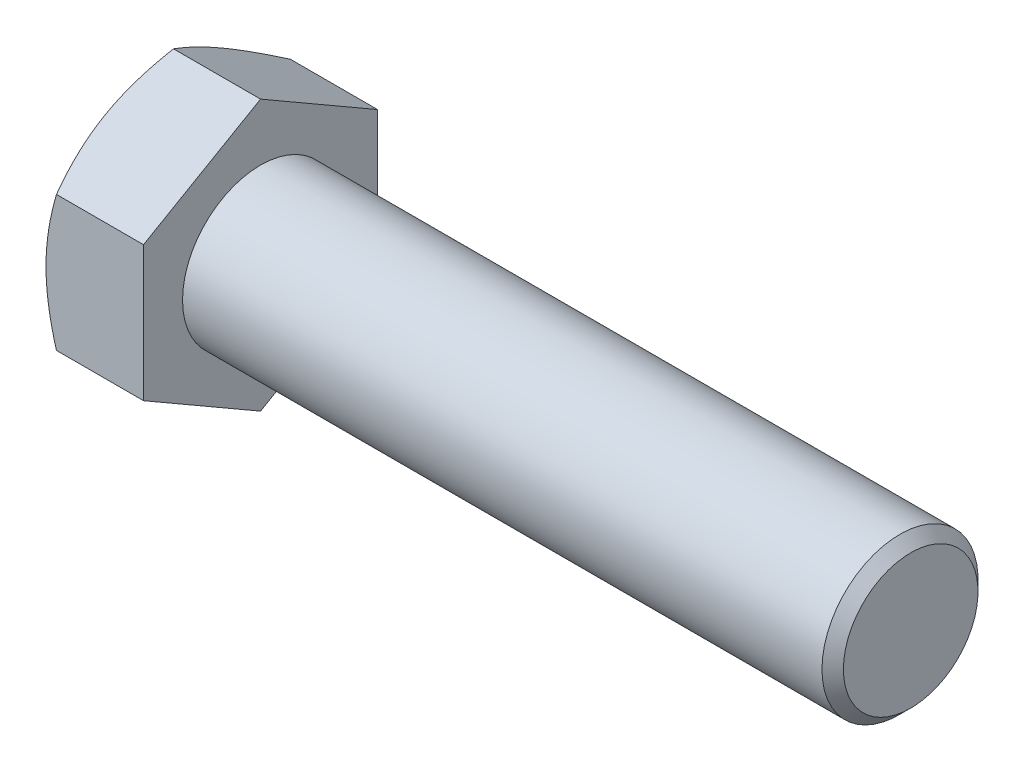
ISO-10303-21;
HEADER;
FILE_DESCRIPTION(('STEP AP214'),'2;1');
FILE_NAME('part.step','',(''),(''),'','','');
FILE_SCHEMA(('AUTOMOTIVE_DESIGN { 1 0 10303 214 1 1 1 1 }'));
ENDSEC;
DATA;
#1=APPLICATION_CONTEXT('core data for automotive mechanical design processes');
#2=APPLICATION_PROTOCOL_DEFINITION('international standard','automotive_design',2000,#1);
#3=PRODUCT_CONTEXT('',#1,'mechanical');
#4=PRODUCT('Part','Part','',(#3));
#5=PRODUCT_RELATED_PRODUCT_CATEGORY('part','',(#4));
#6=PRODUCT_DEFINITION_FORMATION('','',#4);
#7=PRODUCT_DEFINITION_CONTEXT('part definition',#1,'design');
#8=PRODUCT_DEFINITION('design','',#6,#7);
#9=PRODUCT_DEFINITION_SHAPE('','',#8);
#10=(LENGTH_UNIT() NAMED_UNIT(*) SI_UNIT(.MILLI.,.METRE.));
#11=(NAMED_UNIT(*) PLANE_ANGLE_UNIT() SI_UNIT($,.RADIAN.));
#12=(NAMED_UNIT(*) SI_UNIT($,.STERADIAN.) SOLID_ANGLE_UNIT());
#13=UNCERTAINTY_MEASURE_WITH_UNIT(LENGTH_MEASURE(1.E-05),#10,'distance_accuracy_value','');
#14=(GEOMETRIC_REPRESENTATION_CONTEXT(3) GLOBAL_UNCERTAINTY_ASSIGNED_CONTEXT((#13)) GLOBAL_UNIT_ASSIGNED_CONTEXT((#10,
#11,#12)) REPRESENTATION_CONTEXT('',''));
#15=CARTESIAN_POINT('',(0.,0.,0.));
#16=DIRECTION('',(0.,0.,1.));
#17=DIRECTION('',(1.,0.,0.));
#18=AXIS2_PLACEMENT_3D('',#15,#16,#17);
#19=CARTESIAN_POINT('',(15.,10.3923048454132,-18.));
#20=DIRECTION('',(0.,-0.866025403784438,0.500000000000001));
#21=DIRECTION('',(0.,-0.500000000000001,-0.866025403784438));
#22=AXIS2_PLACEMENT_3D('',#19,#20,#21);
#23=PLANE('',#22);
#24=CARTESIAN_POINT('',(1.60776182180895,20.7847251608804,0.000200000000000836));
#25=CARTESIAN_POINT('',(1.47589336556313,20.5563065795853,-0.395432588195887));
#26=CARTESIAN_POINT('',(1.3500088902118,20.3269970432229,-0.792608355835558));
#27=CARTESIAN_POINT('',(1.11187123611099,19.8665391802308,-1.59014476928247));
#28=CARTESIAN_POINT('',(0.999622540659336,19.6353902753093,-1.99050641672051));
#29=CARTESIAN_POINT('',(0.790265297583971,19.1708069369103,-2.79518836317754));
#30=CARTESIAN_POINT('',(0.693192573141017,18.9373684378805,-3.19951570393978));
#31=CARTESIAN_POINT('',(0.516271743787666,18.4688693838575,-4.01097986880547));
#32=CARTESIAN_POINT('',(0.436422652420744,18.2338089225559,-4.41811653063042));
#33=CARTESIAN_POINT('',(0.29734530285486,17.7680889877957,-5.22476711973284));
#34=CARTESIAN_POINT('',(0.237656723113628,17.537464089243,-5.62422116151642));
#35=CARTESIAN_POINT('',(0.137572375669449,17.0751575359747,-6.42495960044929));
#36=CARTESIAN_POINT('',(0.0971769793251374,16.8434758610046,-6.82624403268017));
#37=CARTESIAN_POINT('',(0.0366989588175652,16.3797233284791,-7.62948698115295));
#38=CARTESIAN_POINT('',(0.0165921970388512,16.1476532631882,-8.03144412515262));
#39=CARTESIAN_POINT('',(-0.00287614600259145,15.6832989242254,-8.83572943295137));
#40=CARTESIAN_POINT('',(-0.00223836829112604,15.4510146573942,-9.23805758490178));
#41=CARTESIAN_POINT('',(0.0183335794963781,15.0167538648571,-9.99021934131111));
#42=CARTESIAN_POINT('',(0.0357591844006452,14.8147463980876,-10.3401065372642));
#43=CARTESIAN_POINT('',(0.0859690685012147,14.4112133300948,-11.0390463135619));
#44=CARTESIAN_POINT('',(0.118753127736265,14.209687722012,-11.3880989057876));
#45=CARTESIAN_POINT('',(0.199111057578677,13.8071947240359,-12.0852372279728));
#46=CARTESIAN_POINT('',(0.246698302564822,13.6062280054156,-12.4333217952535));
#47=CARTESIAN_POINT('',(0.355822876567433,13.2052512562621,-13.1278338974413));
#48=CARTESIAN_POINT('',(0.417360146472625,13.0052412216786,-13.4742614393635));
#49=CARTESIAN_POINT('',(0.624462075708551,12.3980849696691,-14.525886915977));
#50=CARTESIAN_POINT('',(0.790677467933134,11.99269701467,-15.228039450812));
#51=CARTESIAN_POINT('',(1.16791817029879,11.1879658503706,-16.6218747138126));
#52=CARTESIAN_POINT('',(1.37885488712769,10.78861233823,-17.3135752870211));
#53=CARTESIAN_POINT('',(1.60776182180894,10.3921893753594,-18.0002));
#54=B_SPLINE_CURVE_WITH_KNOTS('',3,(#24,#25,#26,#27,#28,#29,#30,#31,#32,#33,#34,#35,#36,#37,#38,
#39,#40,#41,#42,#43,#44,#45,#46,#47,#48,#49,#50,#51,#52,#53),.UNSPECIFIED.,.F.,.F.,(4,2,2,2,2,2,
2,2,2,2,2,2,2,2,4),(0.,1.42650335783821,2.85347447244913,4.28376471280638,5.71397301377359,
7.10888071673009,8.50381526803682,9.89708828642551,11.2903182514068,12.5031974791545,
13.7160593367768,14.9300201888636,16.1439758970578,18.6253607678546,21.1018751738864),.UNSPECIFIED.);
#55=CARTESIAN_POINT('',(1.60769515458673,20.7846096908265,0.));
#56=VERTEX_POINT('',#55);
#57=CARTESIAN_POINT('',(0.,15.5884572681199,-9.00000000000002));
#58=VERTEX_POINT('',#57);
#59=EDGE_CURVE('E49',#56,#58,#54,.T.);
#60=ORIENTED_EDGE('',*,*,#59,.F.);
#61=DIRECTION('',(-1.,0.,0.));
#62=VECTOR('',#61,1.);
#63=CARTESIAN_POINT('',(15.,20.7846096908265,0.));
#64=LINE('',#63,#62);
#65=CARTESIAN_POINT('',(15.,20.7846096908265,0.));
#66=VERTEX_POINT('',#65);
#67=EDGE_CURVE('E145',#66,#56,#64,.T.);
#68=ORIENTED_EDGE('',*,*,#67,.F.);
#69=DIRECTION('',(0.,0.500000000000001,0.866025403784438));
#70=VECTOR('',#69,1.);
#71=CARTESIAN_POINT('',(15.,10.3923048454132,-18.));
#72=LINE('',#71,#70);
#73=CARTESIAN_POINT('',(15.,10.3923048454132,-18.));
#74=VERTEX_POINT('',#73);
#75=EDGE_CURVE('E236',#74,#66,#72,.T.);
#76=ORIENTED_EDGE('',*,*,#75,.F.);
#77=DIRECTION('',(-1.,0.,0.));
#78=VECTOR('',#77,1.);
#79=CARTESIAN_POINT('',(15.,10.3923048454132,-18.));
#80=LINE('',#79,#78);
#81=CARTESIAN_POINT('',(1.60769515458672,10.3923048454132,-18.));
#82=VERTEX_POINT('',#81);
#83=EDGE_CURVE('E133',#74,#82,#80,.T.);
#84=ORIENTED_EDGE('',*,*,#83,.T.);
#85=EDGE_CURVE('E127',#58,#82,#54,.T.);
#86=ORIENTED_EDGE('',*,*,#85,.F.);
#87=EDGE_LOOP('',(#60,#68,#76,#84,#86));
#88=FACE_BOUND('',#87,.T.);
#89=ADVANCED_FACE('F33',(#88),#23,.F.);
#90=CARTESIAN_POINT('',(15.,20.7846096908265,0.));
#91=DIRECTION('',(0.,-0.866025403784438,-0.500000000000001));
#92=DIRECTION('',(0.,0.500000000000001,-0.866025403784438));
#93=AXIS2_PLACEMENT_3D('',#90,#91,#92);
#94=PLANE('',#93);
#95=CARTESIAN_POINT('',(1.60776182180894,10.3921893753594,18.0002));
#96=CARTESIAN_POINT('',(1.47589336556312,10.6206079566545,17.6045674118041));
#97=CARTESIAN_POINT('',(1.35000889021179,10.8499174930169,17.2073916441644));
#98=CARTESIAN_POINT('',(1.11187123611098,11.310375356009,16.4098552307175));
#99=CARTESIAN_POINT('',(0.999622540659326,11.5415242609305,16.0094935832795));
#100=CARTESIAN_POINT('',(0.790265297583962,12.0061075993295,15.2048116368225));
#101=CARTESIAN_POINT('',(0.693192573141009,12.2395460983593,14.8004842960602));
#102=CARTESIAN_POINT('',(0.51627174378766,12.7080451523823,13.9890201311945));
#103=CARTESIAN_POINT('',(0.436422652420739,12.9431056136839,13.5818834693696));
#104=CARTESIAN_POINT('',(0.297345302854857,13.4088255484441,12.7752328802672));
#105=CARTESIAN_POINT('',(0.237656723113625,13.6394504469968,12.3757788384836));
#106=CARTESIAN_POINT('',(0.137572375669447,14.1017570002651,11.5750403995507));
#107=CARTESIAN_POINT('',(0.0971769793251351,14.3334386752352,11.1737559673198));
#108=CARTESIAN_POINT('',(0.0366989588175636,14.7971912077607,10.3705130188471));
#109=CARTESIAN_POINT('',(0.0165921970388509,15.0292612730516,9.96855587484738));
#110=CARTESIAN_POINT('',(-0.0028761460025901,15.4936156120144,9.16427056704863));
#111=CARTESIAN_POINT('',(-0.00223836829112426,15.7258998788456,8.76194241509822));
#112=CARTESIAN_POINT('',(0.0183335794963803,16.1601606713826,8.00978065868889));
#113=CARTESIAN_POINT('',(0.0357591844006476,16.3621681381522,7.65989346273577));
#114=CARTESIAN_POINT('',(0.0859690685012189,16.765701206145,6.96095368643809));
#115=CARTESIAN_POINT('',(0.118753127736271,16.9672268142278,6.61190109421242));
#116=CARTESIAN_POINT('',(0.199111057578684,17.3697198122039,5.91476277202716));
#117=CARTESIAN_POINT('',(0.246698302564829,17.5706865308241,5.56667820474646));
#118=CARTESIAN_POINT('',(0.355822876567441,17.9716632799777,4.87216610255867));
#119=CARTESIAN_POINT('',(0.417360146472634,18.1716733145612,4.52573856063651));
#120=CARTESIAN_POINT('',(0.624462075708563,18.7788295665707,3.47411308402299));
#121=CARTESIAN_POINT('',(0.790677467933145,19.1842175215698,2.77196054918801));
#122=CARTESIAN_POINT('',(1.1679181702988,19.9889486858692,1.37812528618742));
#123=CARTESIAN_POINT('',(1.3788548871277,20.3883021980098,0.686424712978885));
#124=CARTESIAN_POINT('',(1.60776182180895,20.7847251608804,-0.000200000000000834));
#125=B_SPLINE_CURVE_WITH_KNOTS('',3,(#95,#96,#97,#98,#99,#100,#101,#102,#103,#104,#105,#106,
#107,#108,#109,#110,#111,#112,#113,#114,#115,#116,#117,#118,#119,#120,#121,#122,#123,#124),
.UNSPECIFIED.,.F.,.F.,(4,2,2,2,2,2,2,2,2,2,2,2,2,2,4),(0.,1.42650335783822,2.85347447244913,
4.28376471280638,5.71397301377359,7.10888071673008,8.50381526803681,9.8970882864255,
11.2903182514068,12.5031974791544,13.7160593367768,14.9300201888636,16.1439758970578,
18.6253607678546,21.1018751738864),.UNSPECIFIED.);
#126=CARTESIAN_POINT('',(1.60769515458672,10.3923048454133,18.));
#127=VERTEX_POINT('',#126);
#128=CARTESIAN_POINT('',(0.,15.5884572681199,9.00000000000002));
#129=VERTEX_POINT('',#128);
#130=EDGE_CURVE('E56',#127,#129,#125,.T.);
#131=ORIENTED_EDGE('',*,*,#130,.F.);
#132=DIRECTION('',(-1.,0.,0.));
#133=VECTOR('',#132,1.);
#134=CARTESIAN_POINT('',(15.,10.3923048454133,18.));
#135=LINE('',#134,#133);
#136=CARTESIAN_POINT('',(15.,10.3923048454133,18.));
#137=VERTEX_POINT('',#136);
#138=EDGE_CURVE('E143',#137,#127,#135,.T.);
#139=ORIENTED_EDGE('',*,*,#138,.F.);
#140=DIRECTION('',(0.,-0.500000000000001,0.866025403784438));
#141=VECTOR('',#140,1.);
#142=CARTESIAN_POINT('',(15.,20.7846096908265,0.));
#143=LINE('',#142,#141);
#144=EDGE_CURVE('E234',#66,#137,#143,.T.);
#145=ORIENTED_EDGE('',*,*,#144,.F.);
#146=ORIENTED_EDGE('',*,*,#67,.T.);
#147=EDGE_CURVE('E160',#129,#56,#125,.T.);
#148=ORIENTED_EDGE('',*,*,#147,.F.);
#149=EDGE_LOOP('',(#131,#139,#145,#146,#148));
#150=FACE_BOUND('',#149,.T.);
#151=ADVANCED_FACE('F166',(#150),#94,.F.);
#152=CARTESIAN_POINT('',(15.,10.3923048454133,18.));
#153=DIRECTION('',(0.,0.,-1.));
#154=DIRECTION('',(0.,1.,0.));
#155=AXIS2_PLACEMENT_3D('',#152,#153,#154);
#156=PLANE('',#155);
#157=CARTESIAN_POINT('',(8.808427130496,-27.9643402431046,18.));
#158=CARTESIAN_POINT('',(8.61750677802229,-27.5710662073959,18.));
#159=CARTESIAN_POINT('',(8.42753472732277,-27.1773320233033,18.));
#160=CARTESIAN_POINT('',(8.04970189891834,-26.3888473520457,18.));
#161=CARTESIAN_POINT('',(7.86184114230335,-25.9940968547769,18.));
#162=CARTESIAN_POINT('',(7.30169863346519,-24.8080724634241,18.));
#163=CARTESIAN_POINT('',(6.93291289399547,-24.0151412252697,18.));
#164=CARTESIAN_POINT('',(6.20490967153255,-22.4196974027513,18.));
#165=CARTESIAN_POINT('',(5.84575478283093,-21.6171561882138,18.));
#166=CARTESIAN_POINT('',(5.14207064659814,-20.0057089274192,18.));
#167=CARTESIAN_POINT('',(4.79754071148437,-19.1968031825104,18.));
#168=CARTESIAN_POINT('',(4.11611022257428,-17.5450041866493,18.));
#169=CARTESIAN_POINT('',(3.77981809482908,-16.7018586270337,18.));
#170=CARTESIAN_POINT('',(3.13256514784992,-15.0057154320914,18.));
#171=CARTESIAN_POINT('',(2.82160716489197,-14.1527167058291,18.));
#172=CARTESIAN_POINT('',(2.23315455016408,-12.43711867356,18.));
#173=CARTESIAN_POINT('',(1.95559259436132,-11.5745426460692,18.));
#174=CARTESIAN_POINT('',(1.44279031196762,-9.83693542713535,18.));
#175=CARTESIAN_POINT('',(1.20753670684013,-8.96190823687535,18.));
#176=CARTESIAN_POINT('',(0.895522308058553,-7.64230427801033,18.));
#177=CARTESIAN_POINT('',(0.798539960307999,-7.20248011867895,18.));
#178=CARTESIAN_POINT('',(0.61934666397991,-6.31981731439132,18.));
#179=CARTESIAN_POINT('',(0.537135413912321,-5.87697873115342,18.));
#180=CARTESIAN_POINT('',(0.388933808123912,-4.98859702789482,18.));
#181=CARTESIAN_POINT('',(0.322942911246029,-4.54305399861045,18.));
#182=CARTESIAN_POINT('',(0.208492383577689,-3.64970631100975,18.));
#183=CARTESIAN_POINT('',(0.160032741349877,-3.20190165416909,18.));
#184=CARTESIAN_POINT('',(0.0822220075298186,-2.31054962941571,18.));
#185=CARTESIAN_POINT('',(0.0526283717185129,-1.86702356479736,18.));
#186=CARTESIAN_POINT('',(0.012226539215199,-0.979118128922018,18.));
#187=CARTESIAN_POINT('',(0.00141802963593598,-0.534738772000976,18.));
#188=CARTESIAN_POINT('',(-0.00115631762080865,0.35407970684775,18.));
#189=CARTESIAN_POINT('',(0.00707792061225486,0.798518829006617,18.));
#190=CARTESIAN_POINT('',(0.0423876675323175,1.68665283494852,18.));
#191=CARTESIAN_POINT('',(0.069464021130165,2.13034768446277,18.));
#192=CARTESIAN_POINT('',(0.156482092926351,3.19520589070312,18.));
#193=CARTESIAN_POINT('',(0.225281528377599,3.81565824171455,18.));
#194=CARTESIAN_POINT('',(0.395990058380339,5.05199420564998,18.));
#195=CARTESIAN_POINT('',(0.497903614582591,5.66787719147405,18.));
#196=CARTESIAN_POINT('',(0.731215030304267,6.89447554273952,18.));
#197=CARTESIAN_POINT('',(0.862635769426437,7.50518651446561,18.));
#198=CARTESIAN_POINT('',(1.15094813703739,8.72049972355144,18.));
#199=CARTESIAN_POINT('',(1.30783938943284,9.3251020509704,18.));
#200=CARTESIAN_POINT('',(1.64698004778297,10.5414936469055,18.));
#201=CARTESIAN_POINT('',(1.82971241990763,11.1531473228725,18.));
#202=CARTESIAN_POINT('',(2.21414736076856,12.3704299751548,18.));
#203=CARTESIAN_POINT('',(2.41585005430054,12.9760589118076,18.));
#204=CARTESIAN_POINT('',(2.83501520647244,14.1815895178699,18.));
#205=CARTESIAN_POINT('',(3.05247247513773,14.7814930003558,18.));
#206=CARTESIAN_POINT('',(3.50057968346486,15.9763233426994,18.));
#207=CARTESIAN_POINT('',(3.73122947137528,16.5712502597116,18.));
#208=CARTESIAN_POINT('',(4.28861115018066,17.9702204857275,18.));
#209=CARTESIAN_POINT('',(4.62002515649325,18.7723954680034,18.));
#210=CARTESIAN_POINT('',(5.29890820133677,20.3699430824083,18.));
#211=CARTESIAN_POINT('',(5.64637822330189,21.1653152943209,18.));
#212=CARTESIAN_POINT('',(6.35417286629493,22.7505167275409,18.));
#213=CARTESIAN_POINT('',(6.7145003341077,23.5403446743747,18.));
#214=CARTESIAN_POINT('',(7.44542750445922,25.1152008413773,18.));
#215=CARTESIAN_POINT('',(7.81602698916609,25.9002291628984,18.));
#216=CARTESIAN_POINT('',(8.56599428613879,27.4671332618931,18.));
#217=CARTESIAN_POINT('',(8.94537123353963,28.2490046594181,18.));
#218=CARTESIAN_POINT('',(9.71100797362349,29.8093695492503,18.));
#219=CARTESIAN_POINT('',(10.0972677957068,30.5878630271109,18.));
#220=CARTESIAN_POINT('',(10.8754456131813,32.1418914548454,18.));
#221=CARTESIAN_POINT('',(11.2673628909044,32.9174267644653,18.));
#222=CARTESIAN_POINT('',(12.0559785801665,34.4660583569055,18.));
#223=CARTESIAN_POINT('',(12.4526769828552,35.2391546442373,18.));
#224=CARTESIAN_POINT('',(13.5822142013125,37.4263866617491,18.));
#225=CARTESIAN_POINT('',(14.3197969559458,38.8380724746762,18.));
#226=CARTESIAN_POINT('',(15.8050655327946,41.6561700073892,18.));
#227=CARTESIAN_POINT('',(16.5527517104897,43.0625815393687,18.));
#228=CARTESIAN_POINT('',(18.0539928572742,45.8677641350797,18.));
#229=CARTESIAN_POINT('',(18.8075285851389,47.2665455031668,18.));
#230=CARTESIAN_POINT('',(19.942334530836,49.3622270652889,18.));
#231=CARTESIAN_POINT('',(20.3213432724281,50.0603536788783,18.));
#232=CARTESIAN_POINT('',(21.0807116459902,51.4558704710998,18.));
#233=CARTESIAN_POINT('',(21.4610712758458,52.1532606508822,18.));
#234=CARTESIAN_POINT('',(21.8420286714726,52.850324235841,18.));
#235=B_SPLINE_CURVE_WITH_KNOTS('',3,(#157,#158,#159,#160,#161,#162,#163,#164,#165,#166,#167,
#168,#169,#170,#171,#172,#173,#174,#175,#176,#177,#178,#179,#180,#181,#182,#183,#184,#185,#186,
#187,#188,#189,#190,#191,#192,#193,#194,#195,#196,#197,#198,#199,#200,#201,#202,#203,#204,#205,
#206,#207,#208,#209,#210,#211,#212,#213,#214,#215,#216,#217,#218,#219,#220,#221,#222,#223,#224,
#225,#226,#227,#228,#229,#230,#231,#232,#233,#234),.UNSPECIFIED.,.F.,.F.,(4,2,2,2,2,2,2,2,2,2,2,
2,2,2,2,2,2,2,2,2,2,2,2,2,2,2,2,2,2,2,2,2,2,2,2,2,2,2,4),(0.,1.31149885283058,2.62301079472824,
5.24642021614437,7.88402931842207,10.5215142775822,13.2444150325257,15.9676202112372,
18.6852401997085,21.4020057650649,22.7529669019192,24.1039004614305,25.4547889438409,
26.8056765449329,28.1388267463276,29.4719547424042,30.8050880527688,32.138281146834,
34.0100119547707,35.8819950561187,37.7554347199951,39.628846723491,41.5435776020437,
43.4583210774805,45.3724366289069,47.286530166998,49.890113594,52.4938567029427,
55.0981799317037,57.7024479744958,60.3095605480866,62.9166842606504,65.5234801070603,
68.1302711287376,72.908489911859,77.6868772522354,82.4533702914907,84.8364880602421,
87.2196021009334),.UNSPECIFIED.);
#236=CARTESIAN_POINT('',(1.60769515458671,-10.3923048454132,18.));
#237=VERTEX_POINT('',#236);
#238=CARTESIAN_POINT('',(0.,0.,18.));
#239=VERTEX_POINT('',#238);
#240=EDGE_CURVE('E246',#237,#239,#235,.T.);
#241=ORIENTED_EDGE('',*,*,#240,.F.);
#242=DIRECTION('',(-1.,0.,0.));
#243=VECTOR('',#242,1.);
#244=CARTESIAN_POINT('',(15.,-10.3923048454132,18.));
#245=LINE('',#244,#243);
#246=CARTESIAN_POINT('',(15.,-10.3923048454132,18.));
#247=VERTEX_POINT('',#246);
#248=EDGE_CURVE('E135',#247,#237,#245,.T.);
#249=ORIENTED_EDGE('',*,*,#248,.F.);
#250=DIRECTION('',(0.,-1.,0.));
#251=VECTOR('',#250,1.);
#252=CARTESIAN_POINT('',(15.,10.3923048454133,18.));
#253=LINE('',#252,#251);
#254=EDGE_CURVE('E230',#137,#247,#253,.T.);
#255=ORIENTED_EDGE('',*,*,#254,.F.);
#256=ORIENTED_EDGE('',*,*,#138,.T.);
#257=EDGE_CURVE('E184',#239,#127,#235,.T.);
#258=ORIENTED_EDGE('',*,*,#257,.F.);
#259=EDGE_LOOP('',(#241,#249,#255,#256,#258));
#260=FACE_BOUND('',#259,.T.);
#261=ADVANCED_FACE('F252',(#260),#156,.F.);
#262=CARTESIAN_POINT('',(15.,-20.7846096908265,0.));
#263=DIRECTION('',(0.,0.866025403784437,-0.500000000000002));
#264=DIRECTION('',(0.,0.500000000000002,0.866025403784438));
#265=AXIS2_PLACEMENT_3D('',#262,#263,#264);
#266=PLANE('',#265);
#267=CARTESIAN_POINT('',(1.60776182180895,-20.7847251608804,-0.000200000000000067));
#268=CARTESIAN_POINT('',(1.47589336556313,-20.5563065795853,0.395432588195888));
#269=CARTESIAN_POINT('',(1.35000889021179,-20.3269970432229,0.79260835583556));
#270=CARTESIAN_POINT('',(1.11187123611098,-19.8665391802308,1.59014476928247));
#271=CARTESIAN_POINT('',(0.999622540659329,-19.6353902753093,1.99050641672051));
#272=CARTESIAN_POINT('',(0.790265297583964,-19.1708069369103,2.79518836317754));
#273=CARTESIAN_POINT('',(0.693192573141011,-18.9373684378805,3.19951570393978));
#274=CARTESIAN_POINT('',(0.516271743787659,-18.4688693838575,4.01097986880547));
#275=CARTESIAN_POINT('',(0.436422652420737,-18.2338089225559,4.41811653063042));
#276=CARTESIAN_POINT('',(0.297345302854853,-17.7680889877957,5.22476711973284));
#277=CARTESIAN_POINT('',(0.237656723113621,-17.537464089243,5.62422116151642));
#278=CARTESIAN_POINT('',(0.137572375669442,-17.0751575359747,6.42495960044928));
#279=CARTESIAN_POINT('',(0.0971769793251287,-16.8434758610045,6.82624403268017));
#280=CARTESIAN_POINT('',(0.0366989588175549,-16.3797233284791,7.62948698115294));
#281=CARTESIAN_POINT('',(0.0165921970388408,-16.1476532631882,8.03144412515262));
#282=CARTESIAN_POINT('',(-0.00287614600260201,-15.6832989242253,8.83572943295136));
#283=CARTESIAN_POINT('',(-0.00223836829113659,-15.4510146573942,9.23805758490178));
#284=CARTESIAN_POINT('',(0.0183335794963686,-15.0167538648571,9.9902193413111));
#285=CARTESIAN_POINT('',(0.0357591844006367,-14.8147463980876,10.3401065372642));
#286=CARTESIAN_POINT('',(0.0859690685012056,-14.4112133300948,11.0390463135619));
#287=CARTESIAN_POINT('',(0.118753127736255,-14.209687722012,11.3880989057876));
#288=CARTESIAN_POINT('',(0.199111057578666,-13.8071947240359,12.0852372279728));
#289=CARTESIAN_POINT('',(0.246698302564811,-13.6062280054156,12.4333217952535));
#290=CARTESIAN_POINT('',(0.355822876567423,-13.205251256262,13.1278338974413));
#291=CARTESIAN_POINT('',(0.417360146472615,-13.0052412216786,13.4742614393635));
#292=CARTESIAN_POINT('',(0.624462075708542,-12.3980849696691,14.525886915977));
#293=CARTESIAN_POINT('',(0.790677467933124,-11.9926970146699,15.228039450812));
#294=CARTESIAN_POINT('',(1.16791817029878,-11.1879658503706,16.6218747138126));
#295=CARTESIAN_POINT('',(1.37885488712768,-10.78861233823,17.3135752870211));
#296=CARTESIAN_POINT('',(1.60776182180893,-10.3921893753594,18.0002));
#297=B_SPLINE_CURVE_WITH_KNOTS('',3,(#267,#268,#269,#270,#271,#272,#273,#274,#275,#276,#277,
#278,#279,#280,#281,#282,#283,#284,#285,#286,#287,#288,#289,#290,#291,#292,#293,#294,#295,#296),
.UNSPECIFIED.,.F.,.F.,(4,2,2,2,2,2,2,2,2,2,2,2,2,2,4),(0.,1.42650335783821,2.85347447244913,
4.28376471280638,5.71397301377359,7.10888071673008,8.50381526803681,9.8970882864255,
11.2903182514068,12.5031974791544,13.7160593367768,14.9300201888636,16.1439758970578,
18.6253607678546,21.1018751738865),.UNSPECIFIED.);
#298=CARTESIAN_POINT('',(1.60769515458673,-20.7846096908265,0.));
#299=VERTEX_POINT('',#298);
#300=CARTESIAN_POINT('',(0.,-15.5884572681199,9.00000000000004));
#301=VERTEX_POINT('',#300);
#302=EDGE_CURVE('E168',#299,#301,#297,.T.);
#303=ORIENTED_EDGE('',*,*,#302,.F.);
#304=DIRECTION('',(-1.,0.,0.));
#305=VECTOR('',#304,1.);
#306=CARTESIAN_POINT('',(15.,-20.7846096908265,0.));
#307=LINE('',#306,#305);
#308=CARTESIAN_POINT('',(15.,-20.7846096908265,0.));
#309=VERTEX_POINT('',#308);
#310=EDGE_CURVE('E132',#309,#299,#307,.T.);
#311=ORIENTED_EDGE('',*,*,#310,.F.);
#312=DIRECTION('',(0.,-0.500000000000002,-0.866025403784437));
#313=VECTOR('',#312,1.);
#314=CARTESIAN_POINT('',(15.,-20.7846096908265,0.));
#315=LINE('',#314,#313);
#316=EDGE_CURVE('E228',#247,#309,#315,.T.);
#317=ORIENTED_EDGE('',*,*,#316,.F.);
#318=ORIENTED_EDGE('',*,*,#248,.T.);
#319=EDGE_CURVE('E170',#301,#237,#297,.T.);
#320=ORIENTED_EDGE('',*,*,#319,.F.);
#321=EDGE_LOOP('',(#303,#311,#317,#318,#320));
#322=FACE_BOUND('',#321,.T.);
#323=ADVANCED_FACE('F224',(#322),#266,.F.);
#324=CARTESIAN_POINT('',(15.,-10.3923048454133,-18.));
#325=DIRECTION('',(0.,0.866025403784439,0.5));
#326=DIRECTION('',(0.,-0.5,0.866025403784439));
#327=AXIS2_PLACEMENT_3D('',#324,#325,#326);
#328=PLANE('',#327);
#329=CARTESIAN_POINT('',(1.60776182180895,-10.3921893753594,-18.0002));
#330=CARTESIAN_POINT('',(1.47589336556313,-10.6206079566545,-17.6045674118041));
#331=CARTESIAN_POINT('',(1.3500088902118,-10.8499174930169,-17.2073916441644));
#332=CARTESIAN_POINT('',(1.11187123611099,-11.310375356009,-16.4098552307175));
#333=CARTESIAN_POINT('',(0.999622540659336,-11.5415242609305,-16.0094935832795));
#334=CARTESIAN_POINT('',(0.790265297583972,-12.0061075993295,-15.2048116368225));
#335=CARTESIAN_POINT('',(0.693192573141018,-12.2395460983593,-14.8004842960602));
#336=CARTESIAN_POINT('',(0.516271743787668,-12.7080451523823,-13.9890201311945));
#337=CARTESIAN_POINT('',(0.436422652420747,-12.9431056136839,-13.5818834693696));
#338=CARTESIAN_POINT('',(0.297345302854864,-13.4088255484441,-12.7752328802672));
#339=CARTESIAN_POINT('',(0.237656723113632,-13.6394504469968,-12.3757788384836));
#340=CARTESIAN_POINT('',(0.137572375669453,-14.1017570002651,-11.5750403995507));
#341=CARTESIAN_POINT('',(0.0971769793251403,-14.3334386752353,-11.1737559673198));
#342=CARTESIAN_POINT('',(0.0366989588175689,-14.7971912077607,-10.370513018847));
#343=CARTESIAN_POINT('',(0.0165921970388565,-15.0292612730516,-9.96855587484737));
#344=CARTESIAN_POINT('',(-0.0028761460025847,-15.4936156120145,-9.16427056704861));
#345=CARTESIAN_POINT('',(-0.00223836829111947,-15.7258998788456,-8.7619424150982));
#346=CARTESIAN_POINT('',(0.0183335794963855,-16.1601606713827,-8.00978065868888));
#347=CARTESIAN_POINT('',(0.0357591844006535,-16.3621681381522,-7.65989346273576));
#348=CARTESIAN_POINT('',(0.085969068501224,-16.765701206145,-6.96095368643808));
#349=CARTESIAN_POINT('',(0.118753127736275,-16.9672268142278,-6.61190109421241));
#350=CARTESIAN_POINT('',(0.199111057578687,-17.3697198122039,-5.91476277202715));
#351=CARTESIAN_POINT('',(0.246698302564833,-17.5706865308241,-5.56667820474646));
#352=CARTESIAN_POINT('',(0.355822876567444,-17.9716632799777,-4.87216610255866));
#353=CARTESIAN_POINT('',(0.417360146472635,-18.1716733145612,-4.5257385606365));
#354=CARTESIAN_POINT('',(0.624462075708559,-18.7788295665707,-3.47411308402298));
#355=CARTESIAN_POINT('',(0.790677467933142,-19.1842175215698,-2.77196054918801));
#356=CARTESIAN_POINT('',(1.16791817029879,-19.9889486858692,-1.37812528618742));
#357=CARTESIAN_POINT('',(1.3788548871277,-20.3883021980098,-0.686424712978884));
#358=CARTESIAN_POINT('',(1.60776182180895,-20.7847251608804,0.000199999999999858));
#359=B_SPLINE_CURVE_WITH_KNOTS('',3,(#329,#330,#331,#332,#333,#334,#335,#336,#337,#338,#339,
#340,#341,#342,#343,#344,#345,#346,#347,#348,#349,#350,#351,#352,#353,#354,#355,#356,#357,#358),
.UNSPECIFIED.,.F.,.F.,(4,2,2,2,2,2,2,2,2,2,2,2,2,2,4),(0.,1.42650335783821,2.85347447244913,
4.28376471280638,5.71397301377359,7.10888071673009,8.50381526803682,9.89708828642551,
11.2903182514068,12.5031974791545,13.7160593367768,14.9300201888636,16.1439758970578,
18.6253607678546,21.1018751738864),.UNSPECIFIED.);
#360=CARTESIAN_POINT('',(1.60769515458673,-10.3923048454133,-18.));
#361=VERTEX_POINT('',#360);
#362=CARTESIAN_POINT('',(0.,-15.5884572681199,-8.99999999999999));
#363=VERTEX_POINT('',#362);
#364=EDGE_CURVE('E109',#361,#363,#359,.T.);
#365=ORIENTED_EDGE('',*,*,#364,.F.);
#366=DIRECTION('',(-1.,0.,0.));
#367=VECTOR('',#366,1.);
#368=CARTESIAN_POINT('',(15.,-10.3923048454133,-18.));
#369=LINE('',#368,#367);
#370=CARTESIAN_POINT('',(15.,-10.3923048454133,-18.));
#371=VERTEX_POINT('',#370);
#372=EDGE_CURVE('E123',#371,#361,#369,.T.);
#373=ORIENTED_EDGE('',*,*,#372,.F.);
#374=DIRECTION('',(0.,0.5,-0.866025403784439));
#375=VECTOR('',#374,1.);
#376=CARTESIAN_POINT('',(15.,-10.3923048454133,-18.));
#377=LINE('',#376,#375);
#378=EDGE_CURVE('E226',#309,#371,#377,.T.);
#379=ORIENTED_EDGE('',*,*,#378,.F.);
#380=ORIENTED_EDGE('',*,*,#310,.T.);
#381=EDGE_CURVE('E126',#363,#299,#359,.T.);
#382=ORIENTED_EDGE('',*,*,#381,.F.);
#383=EDGE_LOOP('',(#365,#373,#379,#380,#382));
#384=FACE_BOUND('',#383,.T.);
#385=ADVANCED_FACE('F121',(#384),#328,.F.);
#386=CARTESIAN_POINT('',(15.,10.3923048454132,-18.));
#387=DIRECTION('',(0.,0.,1.));
#388=DIRECTION('',(0.,-1.,0.));
#389=AXIS2_PLACEMENT_3D('',#386,#387,#388);
#390=PLANE('',#389);
#391=CARTESIAN_POINT('',(8.80842713097472,-27.9643402440907,-18.));
#392=CARTESIAN_POINT('',(8.617506778491,-27.5710662083654,-18.));
#393=CARTESIAN_POINT('',(8.42753472778147,-27.1773320242562,-18.));
#394=CARTESIAN_POINT('',(8.04970189935704,-26.3888473529655,-18.));
#395=CARTESIAN_POINT('',(7.86184114273206,-25.9940968556801,-18.));
#396=CARTESIAN_POINT('',(7.30169863386396,-24.8080724642775,-18.));
#397=CARTESIAN_POINT('',(6.93291289437432,-24.0151412260899,-18.));
#398=CARTESIAN_POINT('',(6.20490967187157,-22.4196974035044,-18.));
#399=CARTESIAN_POINT('',(5.84575478315001,-21.6171561889331,-18.));
#400=CARTESIAN_POINT('',(5.1420706468777,-20.0057089280707,-18.));
#401=CARTESIAN_POINT('',(4.79754071174434,-19.196803183128,-18.));
#402=CARTESIAN_POINT('',(4.11611022279456,-17.5450041871963,-18.));
#403=CARTESIAN_POINT('',(3.7798180950293,-16.7018586275441,-18.));
#404=CARTESIAN_POINT('',(3.1325651480111,-15.005715432528,-18.));
#405=CARTESIAN_POINT('',(2.82160716503417,-14.1527167062286,-18.));
#406=CARTESIAN_POINT('',(2.23315455027017,-12.4371186738844,-18.));
#407=CARTESIAN_POINT('',(1.95559259445028,-11.5745426463558,-18.));
#408=CARTESIAN_POINT('',(1.44279031202514,-9.8369354273451,-18.));
#409=CARTESIAN_POINT('',(1.20753670688334,-8.96190823704618,-18.));
#410=CARTESIAN_POINT('',(0.895522308081286,-7.64230427811239,-18.));
#411=CARTESIAN_POINT('',(0.798539960323235,-7.20248011875153,-18.));
#412=CARTESIAN_POINT('',(0.619346663982096,-6.31981731440452,-18.));
#413=CARTESIAN_POINT('',(0.537135413908953,-5.87697873113672,-18.));
#414=CARTESIAN_POINT('',(0.388933808111684,-4.98859702781801,-18.));
#415=CARTESIAN_POINT('',(0.322942911230495,-4.54305399850343,-18.));
#416=CARTESIAN_POINT('',(0.208492383558031,-3.64970631084204,-18.));
#417=CARTESIAN_POINT('',(0.160032741329401,-3.20190165397091,-18.));
#418=CARTESIAN_POINT('',(0.082222007510393,-2.31054962915723,-18.));
#419=CARTESIAN_POINT('',(0.0526283717009072,-1.86702356450906,-18.));
#420=CARTESIAN_POINT('',(0.0122265392038566,-0.979118128574127,-18.));
#421=CARTESIAN_POINT('',(0.0014180296290367,-0.534738771623327,-18.));
#422=CARTESIAN_POINT('',(-0.00115631761626913,0.354079707284689,-18.));
#423=CARTESIAN_POINT('',(0.00707792062379077,0.798518829473088,-18.));
#424=CARTESIAN_POINT('',(0.0423876675602103,1.68665283547366,-18.));
#425=CARTESIAN_POINT('',(0.0694640211674182,2.13034768501705,-18.));
#426=CARTESIAN_POINT('',(0.156482092986642,3.19520589130288,-18.));
#427=CARTESIAN_POINT('',(0.225281528451191,3.81565824233053,-18.));
#428=CARTESIAN_POINT('',(0.395990058481245,5.05199420629767,-18.));
#429=CARTESIAN_POINT('',(0.49790361469751,5.66787719213724,-18.));
#430=CARTESIAN_POINT('',(0.731215030447439,6.89447554343314,-18.));
#431=CARTESIAN_POINT('',(0.862635769583851,7.50518651517417,-18.));
#432=CARTESIAN_POINT('',(1.15094813722315,8.72049972428945,-18.));
#433=CARTESIAN_POINT('',(1.30783938963271,9.32510205172292,-18.));
#434=CARTESIAN_POINT('',(1.64698004801114,10.5414936476874,-18.));
#435=CARTESIAN_POINT('',(1.82971242014998,11.1531473236693,-18.));
#436=CARTESIAN_POINT('',(2.21414736103885,12.3704299759813,-18.));
#437=CARTESIAN_POINT('',(2.4158500545846,12.9760589126488,-18.));
#438=CARTESIAN_POINT('',(2.83501520678354,14.1815895187405,-18.));
#439=CARTESIAN_POINT('',(3.05247247546212,14.7814930012409,-18.));
#440=CARTESIAN_POINT('',(3.50057968381538,15.9763233436138,-18.));
#441=CARTESIAN_POINT('',(3.73122947173864,16.5712502606406,-18.));
#442=CARTESIAN_POINT('',(4.28861115056411,17.9702204866666,-18.));
#443=CARTESIAN_POINT('',(4.62002515688315,18.7723954689383,-18.));
#444=CARTESIAN_POINT('',(5.29890820173806,20.3699430833353,-18.));
#445=CARTESIAN_POINT('',(5.64637822370813,21.1653152952441,-18.));
#446=CARTESIAN_POINT('',(6.35417286670989,22.750516728457,-18.));
#447=CARTESIAN_POINT('',(6.71450033452646,23.5403446752873,-18.));
#448=CARTESIAN_POINT('',(7.44542750488467,25.1152008422835,-18.));
#449=CARTESIAN_POINT('',(7.81602698959445,25.9002291638017,-18.));
#450=CARTESIAN_POINT('',(8.56599428657223,27.4671332627904,-18.));
#451=CARTESIAN_POINT('',(8.94537123397526,28.2490046603126,-18.));
#452=CARTESIAN_POINT('',(9.71100797406294,29.8093695501392,-18.));
#453=CARTESIAN_POINT('',(10.0972677961478,30.5878630279972,-18.));
#454=CARTESIAN_POINT('',(10.8754456136253,32.1418914557266,-18.));
#455=CARTESIAN_POINT('',(11.2673628913496,32.9174267653441,-18.));
#456=CARTESIAN_POINT('',(12.0559785806139,34.4660583577795,-18.));
#457=CARTESIAN_POINT('',(12.4526769833034,35.239154645109,-18.));
#458=CARTESIAN_POINT('',(13.5822142017647,37.4263866626177,-18.));
#459=CARTESIAN_POINT('',(14.3197969564005,38.8380724755441,-18.));
#460=CARTESIAN_POINT('',(15.805065533254,41.656170008256,-18.));
#461=CARTESIAN_POINT('',(16.5527517109513,43.062581540235,-18.));
#462=CARTESIAN_POINT('',(18.0539928577398,45.8677641359459,-18.));
#463=CARTESIAN_POINT('',(18.8075285856065,47.2665455040334,-18.));
#464=CARTESIAN_POINT('',(19.9423345313063,49.362227066156,-18.));
#465=CARTESIAN_POINT('',(20.3213432728994,50.0603536797457,-18.));
#466=CARTESIAN_POINT('',(21.0807116464631,51.4558704719676,-18.));
#467=CARTESIAN_POINT('',(21.4610712763196,52.1532606517502,-18.));
#468=CARTESIAN_POINT('',(21.8420286719472,52.8503242367093,-18.));
#469=B_SPLINE_CURVE_WITH_KNOTS('',3,(#391,#392,#393,#394,#395,#396,#397,#398,#399,#400,#401,
#402,#403,#404,#405,#406,#407,#408,#409,#410,#411,#412,#413,#414,#415,#416,#417,#418,#419,#420,
#421,#422,#423,#424,#425,#426,#427,#428,#429,#430,#431,#432,#433,#434,#435,#436,#437,#438,#439,
#440,#441,#442,#443,#444,#445,#446,#447,#448,#449,#450,#451,#452,#453,#454,#455,#456,#457,#458,
#459,#460,#461,#462,#463,#464,#465,#466,#467,#468),.UNSPECIFIED.,.F.,.F.,(4,2,2,2,2,2,2,2,2,2,2,
2,2,2,2,2,2,2,2,2,2,2,2,2,2,2,2,2,2,2,2,2,2,2,2,2,2,2,4),(0.,1.31149885288839,2.62301079484386,
5.24642021637564,7.88402931877025,10.5215142780473,13.244415033115,15.9676202119508,
18.6852402005459,21.4020057660261,22.7529669029715,24.1039004625739,25.4547889450755,
26.8056765462585,28.138826747742,29.4719547439074,30.805088054361,32.1382811485151,
34.0100119565044,35.8819950579052,37.7554347218344,39.6288467253831,41.5435776039908,
43.4583210794826,45.3724366309638,47.2865301691098,49.8901135961075,52.4938567050458,
55.0981799338023,57.70244797659,60.3095605501759,62.9166842627348,65.5234801091398,
68.1302711308122,72.9084899139354,77.6868772543136,82.4533702935725,84.8364880623258,
87.219602103019),.UNSPECIFIED.);
#470=CARTESIAN_POINT('',(0.,0.,-18.));
#471=VERTEX_POINT('',#470);
#472=EDGE_CURVE('E115',#82,#471,#469,.F.);
#473=ORIENTED_EDGE('',*,*,#472,.F.);
#474=ORIENTED_EDGE('',*,*,#83,.F.);
#475=DIRECTION('',(0.,1.,0.));
#476=VECTOR('',#475,1.);
#477=CARTESIAN_POINT('',(15.,10.3923048454132,-18.));
#478=LINE('',#477,#476);
#479=EDGE_CURVE('E131',#371,#74,#478,.T.);
#480=ORIENTED_EDGE('',*,*,#479,.F.);
#481=ORIENTED_EDGE('',*,*,#372,.T.);
#482=EDGE_CURVE('E106',#471,#361,#469,.F.);
#483=ORIENTED_EDGE('',*,*,#482,.F.);
#484=EDGE_LOOP('',(#473,#474,#480,#481,#483));
#485=FACE_BOUND('',#484,.T.);
#486=ADVANCED_FACE('F129',(#485),#390,.F.);
#487=CARTESIAN_POINT('',(15.,20.7846096908265,0.));
#488=DIRECTION('',(1.,0.,0.));
#489=DIRECTION('',(0.,0.,-1.));
#490=AXIS2_PLACEMENT_3D('',#487,#488,#489);
#491=PLANE('',#490);
#492=CARTESIAN_POINT('',(15.,0.,0.));
#493=DIRECTION('',(1.,0.,0.));
#494=DIRECTION('',(0.,0.,-1.));
#495=AXIS2_PLACEMENT_3D('',#492,#493,#494);
#496=CIRCLE('',#495,12.);
#497=CARTESIAN_POINT('',(15.,0.,-12.));
#498=VERTEX_POINT('',#497);
#499=EDGE_CURVE('E239',#498,#498,#496,.F.);
#500=ORIENTED_EDGE('',*,*,#499,.T.);
#501=EDGE_LOOP('',(#500));
#502=FACE_BOUND('',#501,.T.);
#503=ORIENTED_EDGE('',*,*,#75,.T.);
#504=ORIENTED_EDGE('',*,*,#144,.T.);
#505=ORIENTED_EDGE('',*,*,#254,.T.);
#506=ORIENTED_EDGE('',*,*,#316,.T.);
#507=ORIENTED_EDGE('',*,*,#378,.T.);
#508=ORIENTED_EDGE('',*,*,#479,.T.);
#509=EDGE_LOOP('',(#503,#504,#505,#506,#507,#508));
#510=FACE_BOUND('',#509,.T.);
#511=ADVANCED_FACE('F254',(#502,#510),#491,.T.);
#512=CARTESIAN_POINT('',(0.,0.,0.));
#513=DIRECTION('',(-1.,0.,0.));
#514=DIRECTION('',(0.,0.,1.));
#515=AXIS2_PLACEMENT_3D('',#512,#513,#514);
#516=CYLINDRICAL_SURFACE('',#515,12.);
#517=ORIENTED_EDGE('',*,*,#499,.F.);
#518=EDGE_LOOP('',(#517));
#519=FACE_BOUND('',#518,.T.);
#520=CARTESIAN_POINT('',(113.352,0.,0.));
#521=DIRECTION('',(-1.,0.,0.));
#522=DIRECTION('',(0.,0.,1.));
#523=AXIS2_PLACEMENT_3D('',#520,#521,#522);
#524=CIRCLE('',#523,12.);
#525=CARTESIAN_POINT('',(113.352,0.,12.));
#526=VERTEX_POINT('',#525);
#527=EDGE_CURVE('E242',#526,#526,#524,.T.);
#528=ORIENTED_EDGE('',*,*,#527,.T.);
#529=EDGE_LOOP('',(#528));
#530=FACE_BOUND('',#529,.T.);
#531=ADVANCED_FACE('F285',(#519,#530),#516,.T.);
#532=CARTESIAN_POINT('',(115.,0.,0.));
#533=DIRECTION('',(-1.,0.,0.));
#534=DIRECTION('',(0.,0.,1.));
#535=AXIS2_PLACEMENT_3D('',#532,#533,#534);
#536=CONICAL_SURFACE('',#535,10.352,0.785398163397441);
#537=ORIENTED_EDGE('',*,*,#527,.F.);
#538=EDGE_LOOP('',(#537));
#539=FACE_BOUND('',#538,.T.);
#540=CARTESIAN_POINT('',(115.,0.,0.));
#541=DIRECTION('',(-1.,0.,0.));
#542=DIRECTION('',(0.,0.,1.));
#543=AXIS2_PLACEMENT_3D('',#540,#541,#542);
#544=CIRCLE('',#543,10.352);
#545=CARTESIAN_POINT('',(115.,0.,10.352));
#546=VERTEX_POINT('',#545);
#547=EDGE_CURVE('E244',#546,#546,#544,.T.);
#548=ORIENTED_EDGE('',*,*,#547,.T.);
#549=EDGE_LOOP('',(#548));
#550=FACE_BOUND('',#549,.T.);
#551=ADVANCED_FACE('F288',(#539,#550),#536,.T.);
#552=CARTESIAN_POINT('',(115.,0.,0.));
#553=DIRECTION('',(-1.,0.,0.));
#554=DIRECTION('',(0.,0.,1.));
#555=AXIS2_PLACEMENT_3D('',#552,#553,#554);
#556=PLANE('',#555);
#557=ORIENTED_EDGE('',*,*,#547,.F.);
#558=EDGE_LOOP('',(#557));
#559=FACE_BOUND('',#558,.T.);
#560=ADVANCED_FACE('F198',(#559),#556,.F.);
#561=CARTESIAN_POINT('',(0.,0.,0.));
#562=DIRECTION('',(1.,0.,0.));
#563=DIRECTION('',(0.,0.,-1.));
#564=AXIS2_PLACEMENT_3D('',#561,#562,#563);
#565=CONICAL_SURFACE('',#564,18.,1.0471975511966);
#566=ORIENTED_EDGE('',*,*,#364,.T.);
#567=CARTESIAN_POINT('',(0.,0.,0.));
#568=DIRECTION('',(1.,0.,0.));
#569=DIRECTION('',(0.,0.,-1.));
#570=AXIS2_PLACEMENT_3D('',#567,#568,#569);
#571=CIRCLE('',#570,18.);
#572=EDGE_CURVE('E37',#363,#471,#571,.T.);
#573=ORIENTED_EDGE('',*,*,#572,.T.);
#574=ORIENTED_EDGE('',*,*,#482,.T.);
#575=EDGE_LOOP('',(#566,#573,#574));
#576=FACE_BOUND('',#575,.T.);
#577=ADVANCED_FACE('F108',(#576),#565,.T.);
#578=ORIENTED_EDGE('',*,*,#302,.T.);
#579=EDGE_CURVE('E150',#301,#363,#571,.T.);
#580=ORIENTED_EDGE('',*,*,#579,.T.);
#581=ORIENTED_EDGE('',*,*,#381,.T.);
#582=EDGE_LOOP('',(#578,#580,#581));
#583=FACE_BOUND('',#582,.T.);
#584=ADVANCED_FACE('F197',(#583),#565,.T.);
#585=ORIENTED_EDGE('',*,*,#240,.T.);
#586=EDGE_CURVE('E151',#239,#301,#571,.T.);
#587=ORIENTED_EDGE('',*,*,#586,.T.);
#588=ORIENTED_EDGE('',*,*,#319,.T.);
#589=EDGE_LOOP('',(#585,#587,#588));
#590=FACE_BOUND('',#589,.T.);
#591=ADVANCED_FACE('F192',(#590),#565,.T.);
#592=ORIENTED_EDGE('',*,*,#257,.T.);
#593=ORIENTED_EDGE('',*,*,#130,.T.);
#594=CARTESIAN_POINT('',(0.,0.,0.));
#595=DIRECTION('',(-1.,0.,0.));
#596=DIRECTION('',(0.,0.,1.));
#597=AXIS2_PLACEMENT_3D('',#594,#595,#596);
#598=CIRCLE('',#597,18.);
#599=EDGE_CURVE('E116',#239,#129,#598,.T.);
#600=ORIENTED_EDGE('',*,*,#599,.F.);
#601=EDGE_LOOP('',(#592,#593,#600));
#602=FACE_BOUND('',#601,.T.);
#603=ADVANCED_FACE('F196',(#602),#565,.T.);
#604=ORIENTED_EDGE('',*,*,#147,.T.);
#605=ORIENTED_EDGE('',*,*,#59,.T.);
#606=EDGE_CURVE('E42',#58,#129,#571,.T.);
#607=ORIENTED_EDGE('',*,*,#606,.T.);
#608=EDGE_LOOP('',(#604,#605,#607));
#609=FACE_BOUND('',#608,.T.);
#610=ADVANCED_FACE('F159',(#609),#565,.T.);
#611=ORIENTED_EDGE('',*,*,#85,.T.);
#612=ORIENTED_EDGE('',*,*,#472,.T.);
#613=EDGE_CURVE('E11',#471,#58,#571,.T.);
#614=ORIENTED_EDGE('',*,*,#613,.T.);
#615=EDGE_LOOP('',(#611,#612,#614));
#616=FACE_BOUND('',#615,.T.);
#617=ADVANCED_FACE('F257',(#616),#565,.T.);
#618=CARTESIAN_POINT('',(0.,20.7846096908265,0.));
#619=DIRECTION('',(1.,0.,0.));
#620=DIRECTION('',(0.,0.,-1.));
#621=AXIS2_PLACEMENT_3D('',#618,#619,#620);
#622=PLANE('',#621);
#623=ORIENTED_EDGE('',*,*,#613,.F.);
#624=ORIENTED_EDGE('',*,*,#572,.F.);
#625=ORIENTED_EDGE('',*,*,#579,.F.);
#626=ORIENTED_EDGE('',*,*,#586,.F.);
#627=ORIENTED_EDGE('',*,*,#599,.T.);
#628=ORIENTED_EDGE('',*,*,#606,.F.);
#629=EDGE_LOOP('',(#623,#624,#625,#626,#627,#628));
#630=FACE_BOUND('',#629,.T.);
#631=ADVANCED_FACE('F163',(#630),#622,.F.);
#632=CLOSED_SHELL('',(#89,#151,#261,#323,#385,#486,#511,#531,#551,#560,#577,#584,#591,#603,#610,
#617,#631));
#633=MANIFOLD_SOLID_BREP('B2',#632);
#634=ADVANCED_BREP_SHAPE_REPRESENTATION('',(#18,#633),#14);
#635=SHAPE_DEFINITION_REPRESENTATION(#9,#634);
ENDSEC;
END-ISO-10303-21;
